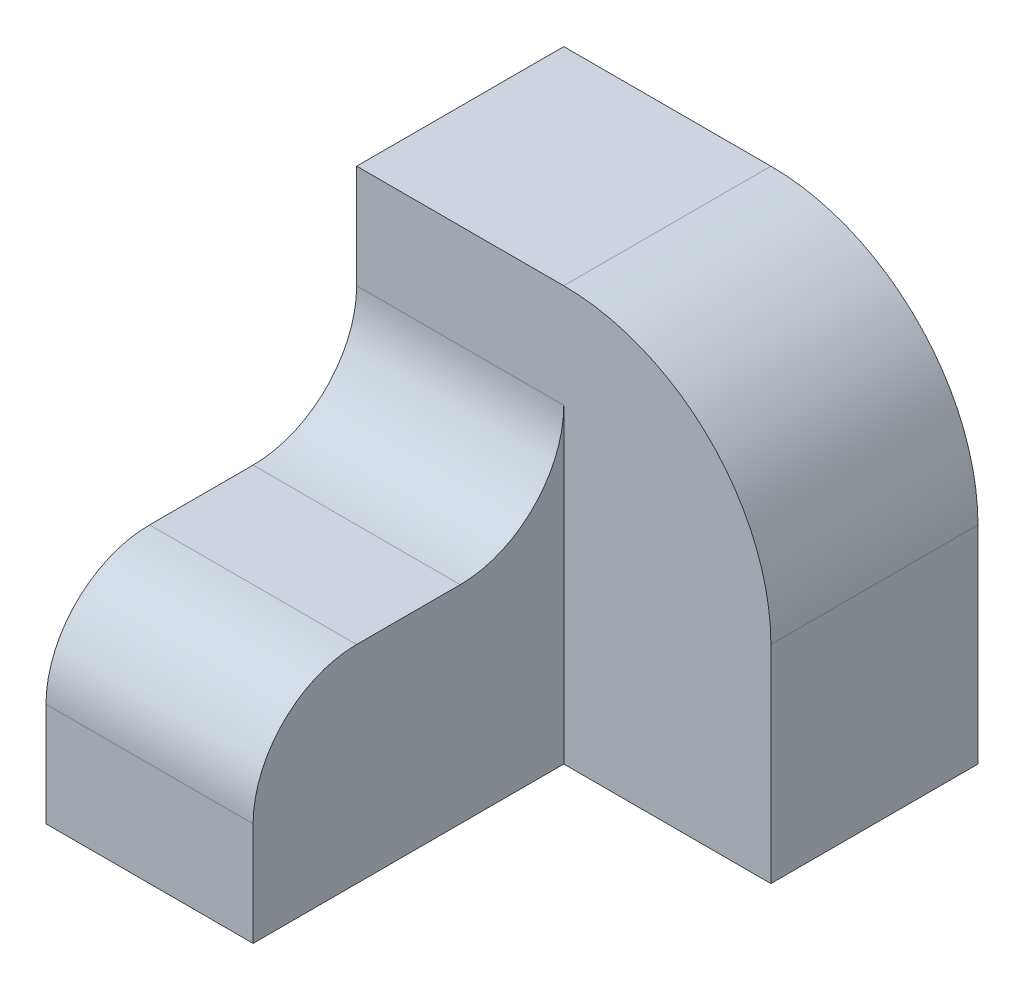
ISO-10303-21;
HEADER;
FILE_DESCRIPTION(('STEP AP214'),'2;1');
FILE_NAME('part.step','',(''),(''),'','','');
FILE_SCHEMA(('AUTOMOTIVE_DESIGN { 1 0 10303 214 1 1 1 1 }'));
ENDSEC;
DATA;
#1=APPLICATION_CONTEXT('core data for automotive mechanical design processes');
#2=APPLICATION_PROTOCOL_DEFINITION('international standard','automotive_design',2000,#1);
#3=PRODUCT_CONTEXT('',#1,'mechanical');
#4=PRODUCT('Part','Part','',(#3));
#5=PRODUCT_RELATED_PRODUCT_CATEGORY('part','',(#4));
#6=PRODUCT_DEFINITION_FORMATION('','',#4);
#7=PRODUCT_DEFINITION_CONTEXT('part definition',#1,'design');
#8=PRODUCT_DEFINITION('design','',#6,#7);
#9=PRODUCT_DEFINITION_SHAPE('','',#8);
#10=(LENGTH_UNIT() NAMED_UNIT(*) SI_UNIT(.MILLI.,.METRE.));
#11=(NAMED_UNIT(*) PLANE_ANGLE_UNIT() SI_UNIT($,.RADIAN.));
#12=(NAMED_UNIT(*) SI_UNIT($,.STERADIAN.) SOLID_ANGLE_UNIT());
#13=UNCERTAINTY_MEASURE_WITH_UNIT(LENGTH_MEASURE(1.E-05),#10,'distance_accuracy_value','');
#14=(GEOMETRIC_REPRESENTATION_CONTEXT(3) GLOBAL_UNCERTAINTY_ASSIGNED_CONTEXT((#13)) GLOBAL_UNIT_ASSIGNED_CONTEXT((#10,
#11,#12)) REPRESENTATION_CONTEXT('',''));
#15=CARTESIAN_POINT('',(0.,0.,0.));
#16=DIRECTION('',(0.,0.,1.));
#17=DIRECTION('',(1.,0.,0.));
#18=AXIS2_PLACEMENT_3D('',#15,#16,#17);
#19=CARTESIAN_POINT('',(10.,10.,0.));
#20=DIRECTION('',(1.,0.,0.));
#21=DIRECTION('',(0.,0.,-1.));
#22=AXIS2_PLACEMENT_3D('',#19,#20,#21);
#23=PLANE('',#22);
#24=DIRECTION('',(0.,0.,1.));
#25=VECTOR('',#24,1.);
#26=CARTESIAN_POINT('',(10.,10.,0.));
#27=LINE('',#26,#25);
#28=CARTESIAN_POINT('',(10.,10.,5.));
#29=VERTEX_POINT('',#28);
#30=CARTESIAN_POINT('',(10.,10.,10.));
#31=VERTEX_POINT('',#30);
#32=EDGE_CURVE('E154',#29,#31,#27,.T.);
#33=ORIENTED_EDGE('',*,*,#32,.T.);
#34=CARTESIAN_POINT('',(10.,5.,10.));
#35=DIRECTION('',(1.,0.,0.));
#36=DIRECTION('',(0.,0.,-1.));
#37=AXIS2_PLACEMENT_3D('',#34,#35,#36);
#38=CIRCLE('',#37,5.);
#39=CARTESIAN_POINT('',(10.,5.,15.));
#40=VERTEX_POINT('',#39);
#41=EDGE_CURVE('E182',#31,#40,#38,.T.);
#42=ORIENTED_EDGE('',*,*,#41,.T.);
#43=DIRECTION('',(0.,-1.,0.));
#44=VECTOR('',#43,1.);
#45=CARTESIAN_POINT('',(10.,10.,15.));
#46=LINE('',#45,#44);
#47=CARTESIAN_POINT('',(10.,0.,15.));
#48=VERTEX_POINT('',#47);
#49=EDGE_CURVE('E161',#40,#48,#46,.T.);
#50=ORIENTED_EDGE('',*,*,#49,.T.);
#51=DIRECTION('',(0.,0.,1.));
#52=VECTOR('',#51,1.);
#53=CARTESIAN_POINT('',(10.,0.,0.));
#54=LINE('',#53,#52);
#55=CARTESIAN_POINT('',(10.,0.,0.));
#56=VERTEX_POINT('',#55);
#57=EDGE_CURVE('E153',#56,#48,#54,.T.);
#58=ORIENTED_EDGE('',*,*,#57,.F.);
#59=DIRECTION('',(0.,-1.,0.));
#60=VECTOR('',#59,1.);
#61=CARTESIAN_POINT('',(10.,10.,0.));
#62=LINE('',#61,#60);
#63=CARTESIAN_POINT('',(10.,15.,0.));
#64=VERTEX_POINT('',#63);
#65=EDGE_CURVE('E171',#64,#56,#62,.T.);
#66=ORIENTED_EDGE('',*,*,#65,.F.);
#67=CARTESIAN_POINT('',(10.,15.,5.));
#68=DIRECTION('',(1.,0.,0.));
#69=DIRECTION('',(0.,0.,-1.));
#70=AXIS2_PLACEMENT_3D('',#67,#68,#69);
#71=CIRCLE('',#70,5.);
#72=EDGE_CURVE('E188',#64,#29,#71,.F.);
#73=ORIENTED_EDGE('',*,*,#72,.T.);
#74=EDGE_LOOP('',(#33,#42,#50,#58,#66,#73));
#75=FACE_BOUND('',#74,.T.);
#76=ADVANCED_FACE('F39',(#75),#23,.T.);
#77=CARTESIAN_POINT('',(0.,10.,0.));
#78=DIRECTION('',(1.,0.,0.));
#79=DIRECTION('',(0.,0.,-1.));
#80=AXIS2_PLACEMENT_3D('',#77,#78,#79);
#81=PLANE('',#80);
#82=DIRECTION('',(0.,-1.,0.));
#83=VECTOR('',#82,1.);
#84=CARTESIAN_POINT('',(0.,10.,15.));
#85=LINE('',#84,#83);
#86=CARTESIAN_POINT('',(0.,5.,15.));
#87=VERTEX_POINT('',#86);
#88=CARTESIAN_POINT('',(0.,0.,15.));
#89=VERTEX_POINT('',#88);
#90=EDGE_CURVE('E169',#87,#89,#85,.T.);
#91=ORIENTED_EDGE('',*,*,#90,.F.);
#92=CARTESIAN_POINT('',(0.,5.,10.));
#93=DIRECTION('',(1.,0.,0.));
#94=DIRECTION('',(0.,0.,-1.));
#95=AXIS2_PLACEMENT_3D('',#92,#93,#94);
#96=CIRCLE('',#95,5.);
#97=CARTESIAN_POINT('',(0.,10.,10.));
#98=VERTEX_POINT('',#97);
#99=EDGE_CURVE('E186',#87,#98,#96,.F.);
#100=ORIENTED_EDGE('',*,*,#99,.T.);
#101=DIRECTION('',(0.,0.,1.));
#102=VECTOR('',#101,1.);
#103=CARTESIAN_POINT('',(0.,10.,0.));
#104=LINE('',#103,#102);
#105=CARTESIAN_POINT('',(0.,10.,5.));
#106=VERTEX_POINT('',#105);
#107=EDGE_CURVE('E157',#106,#98,#104,.T.);
#108=ORIENTED_EDGE('',*,*,#107,.F.);
#109=CARTESIAN_POINT('',(0.,15.,5.));
#110=DIRECTION('',(1.,0.,0.));
#111=DIRECTION('',(0.,0.,-1.));
#112=AXIS2_PLACEMENT_3D('',#109,#110,#111);
#113=CIRCLE('',#112,5.);
#114=CARTESIAN_POINT('',(0.,15.,0.));
#115=VERTEX_POINT('',#114);
#116=EDGE_CURVE('E190',#106,#115,#113,.T.);
#117=ORIENTED_EDGE('',*,*,#116,.T.);
#118=DIRECTION('',(0.,-1.,0.));
#119=VECTOR('',#118,1.);
#120=CARTESIAN_POINT('',(0.,20.,0.));
#121=LINE('',#120,#119);
#122=CARTESIAN_POINT('',(0.,20.,0.));
#123=VERTEX_POINT('',#122);
#124=EDGE_CURVE('E123',#123,#115,#121,.T.);
#125=ORIENTED_EDGE('',*,*,#124,.F.);
#126=DIRECTION('',(0.,0.,-1.));
#127=VECTOR('',#126,1.);
#128=CARTESIAN_POINT('',(0.,20.,0.));
#129=LINE('',#128,#127);
#130=CARTESIAN_POINT('',(0.,20.,-10.));
#131=VERTEX_POINT('',#130);
#132=EDGE_CURVE('E130',#123,#131,#129,.T.);
#133=ORIENTED_EDGE('',*,*,#132,.T.);
#134=DIRECTION('',(0.,-1.,0.));
#135=VECTOR('',#134,1.);
#136=CARTESIAN_POINT('',(0.,20.,-10.));
#137=LINE('',#136,#135);
#138=CARTESIAN_POINT('',(0.,0.,-10.));
#139=VERTEX_POINT('',#138);
#140=EDGE_CURVE('E113',#131,#139,#137,.T.);
#141=ORIENTED_EDGE('',*,*,#140,.T.);
#142=DIRECTION('',(0.,0.,1.));
#143=VECTOR('',#142,1.);
#144=CARTESIAN_POINT('',(0.,0.,0.));
#145=LINE('',#144,#143);
#146=EDGE_CURVE('E164',#139,#89,#145,.T.);
#147=ORIENTED_EDGE('',*,*,#146,.T.);
#148=EDGE_LOOP('',(#91,#100,#108,#117,#125,#133,#141,#147));
#149=FACE_BOUND('',#148,.T.);
#150=ADVANCED_FACE('F136',(#149),#81,.F.);
#151=CARTESIAN_POINT('',(0.,10.,15.));
#152=DIRECTION('',(0.,0.,-1.));
#153=DIRECTION('',(-1.,0.,0.));
#154=AXIS2_PLACEMENT_3D('',#151,#152,#153);
#155=PLANE('',#154);
#156=ORIENTED_EDGE('',*,*,#49,.F.);
#157=DIRECTION('',(1.,0.,0.));
#158=VECTOR('',#157,1.);
#159=CARTESIAN_POINT('',(0.,5.,15.));
#160=LINE('',#159,#158);
#161=EDGE_CURVE('E184',#40,#87,#160,.F.);
#162=ORIENTED_EDGE('',*,*,#161,.T.);
#163=ORIENTED_EDGE('',*,*,#90,.T.);
#164=DIRECTION('',(1.,0.,0.));
#165=VECTOR('',#164,1.);
#166=CARTESIAN_POINT('',(0.,0.,15.));
#167=LINE('',#166,#165);
#168=EDGE_CURVE('E158',#89,#48,#167,.T.);
#169=ORIENTED_EDGE('',*,*,#168,.T.);
#170=EDGE_LOOP('',(#156,#162,#163,#169));
#171=FACE_BOUND('',#170,.T.);
#172=ADVANCED_FACE('F213',(#171),#155,.F.);
#173=CARTESIAN_POINT('',(0.,10.,0.));
#174=DIRECTION('',(0.,1.,0.));
#175=DIRECTION('',(0.,0.,1.));
#176=AXIS2_PLACEMENT_3D('',#173,#174,#175);
#177=PLANE('',#176);
#178=ORIENTED_EDGE('',*,*,#32,.F.);
#179=DIRECTION('',(1.,0.,0.));
#180=VECTOR('',#179,1.);
#181=CARTESIAN_POINT('',(0.,10.,5.));
#182=LINE('',#181,#180);
#183=EDGE_CURVE('E180',#29,#106,#182,.F.);
#184=ORIENTED_EDGE('',*,*,#183,.T.);
#185=ORIENTED_EDGE('',*,*,#107,.T.);
#186=DIRECTION('',(1.,0.,0.));
#187=VECTOR('',#186,1.);
#188=CARTESIAN_POINT('',(10.,10.,10.));
#189=LINE('',#188,#187);
#190=EDGE_CURVE('E177',#98,#31,#189,.T.);
#191=ORIENTED_EDGE('',*,*,#190,.T.);
#192=EDGE_LOOP('',(#178,#184,#185,#191));
#193=FACE_BOUND('',#192,.T.);
#194=ADVANCED_FACE('F205',(#193),#177,.T.);
#195=CARTESIAN_POINT('',(0.,0.,0.));
#196=DIRECTION('',(0.,1.,0.));
#197=DIRECTION('',(0.,0.,1.));
#198=AXIS2_PLACEMENT_3D('',#195,#196,#197);
#199=PLANE('',#198);
#200=ORIENTED_EDGE('',*,*,#57,.T.);
#201=ORIENTED_EDGE('',*,*,#168,.F.);
#202=ORIENTED_EDGE('',*,*,#146,.F.);
#203=DIRECTION('',(1.,0.,0.));
#204=VECTOR('',#203,1.);
#205=CARTESIAN_POINT('',(0.,0.,-10.));
#206=LINE('',#205,#204);
#207=CARTESIAN_POINT('',(20.,0.,-10.));
#208=VERTEX_POINT('',#207);
#209=EDGE_CURVE('E118',#139,#208,#206,.T.);
#210=ORIENTED_EDGE('',*,*,#209,.T.);
#211=DIRECTION('',(0.,0.,-1.));
#212=VECTOR('',#211,1.);
#213=CARTESIAN_POINT('',(20.,0.,0.));
#214=LINE('',#213,#212);
#215=CARTESIAN_POINT('',(20.,0.,0.));
#216=VERTEX_POINT('',#215);
#217=EDGE_CURVE('E146',#216,#208,#214,.T.);
#218=ORIENTED_EDGE('',*,*,#217,.F.);
#219=DIRECTION('',(1.,0.,0.));
#220=VECTOR('',#219,1.);
#221=CARTESIAN_POINT('',(0.,0.,0.));
#222=LINE('',#221,#220);
#223=EDGE_CURVE('E143',#56,#216,#222,.T.);
#224=ORIENTED_EDGE('',*,*,#223,.F.);
#225=EDGE_LOOP('',(#200,#201,#202,#210,#218,#224));
#226=FACE_BOUND('',#225,.T.);
#227=ADVANCED_FACE('F217',(#226),#199,.F.);
#228=CARTESIAN_POINT('',(0.,20.,0.));
#229=DIRECTION('',(0.,0.,-1.));
#230=DIRECTION('',(-1.,0.,0.));
#231=AXIS2_PLACEMENT_3D('',#228,#229,#230);
#232=PLANE('',#231);
#233=DIRECTION('',(0.,-1.,0.));
#234=VECTOR('',#233,1.);
#235=CARTESIAN_POINT('',(20.,20.,0.));
#236=LINE('',#235,#234);
#237=CARTESIAN_POINT('',(20.,10.,0.));
#238=VERTEX_POINT('',#237);
#239=EDGE_CURVE('E151',#238,#216,#236,.T.);
#240=ORIENTED_EDGE('',*,*,#239,.F.);
#241=CARTESIAN_POINT('',(10.,10.,0.));
#242=DIRECTION('',(0.,0.,-1.));
#243=DIRECTION('',(-1.,0.,0.));
#244=AXIS2_PLACEMENT_3D('',#241,#242,#243);
#245=CIRCLE('',#244,10.);
#246=CARTESIAN_POINT('',(10.,20.,0.));
#247=VERTEX_POINT('',#246);
#248=EDGE_CURVE('E11',#238,#247,#245,.F.);
#249=ORIENTED_EDGE('',*,*,#248,.T.);
#250=DIRECTION('',(1.,0.,0.));
#251=VECTOR('',#250,1.);
#252=CARTESIAN_POINT('',(0.,20.,0.));
#253=LINE('',#252,#251);
#254=EDGE_CURVE('E133',#123,#247,#253,.T.);
#255=ORIENTED_EDGE('',*,*,#254,.F.);
#256=ORIENTED_EDGE('',*,*,#124,.T.);
#257=DIRECTION('',(1.,0.,0.));
#258=VECTOR('',#257,1.);
#259=CARTESIAN_POINT('',(0.,15.,0.));
#260=LINE('',#259,#258);
#261=EDGE_CURVE('E174',#115,#64,#260,.T.);
#262=ORIENTED_EDGE('',*,*,#261,.T.);
#263=ORIENTED_EDGE('',*,*,#65,.T.);
#264=ORIENTED_EDGE('',*,*,#223,.T.);
#265=EDGE_LOOP('',(#240,#249,#255,#256,#262,#263,#264));
#266=FACE_BOUND('',#265,.T.);
#267=ADVANCED_FACE('F199',(#266),#232,.F.);
#268=CARTESIAN_POINT('',(20.,20.,0.));
#269=DIRECTION('',(-1.,0.,0.));
#270=DIRECTION('',(0.,0.,1.));
#271=AXIS2_PLACEMENT_3D('',#268,#269,#270);
#272=PLANE('',#271);
#273=DIRECTION('',(0.,-1.,0.));
#274=VECTOR('',#273,1.);
#275=CARTESIAN_POINT('',(20.,20.,-10.));
#276=LINE('',#275,#274);
#277=CARTESIAN_POINT('',(20.,10.,-10.));
#278=VERTEX_POINT('',#277);
#279=EDGE_CURVE('E122',#278,#208,#276,.T.);
#280=ORIENTED_EDGE('',*,*,#279,.F.);
#281=DIRECTION('',(0.,0.,-1.));
#282=VECTOR('',#281,1.);
#283=CARTESIAN_POINT('',(20.,10.,0.));
#284=LINE('',#283,#282);
#285=EDGE_CURVE('E47',#278,#238,#284,.F.);
#286=ORIENTED_EDGE('',*,*,#285,.T.);
#287=ORIENTED_EDGE('',*,*,#239,.T.);
#288=ORIENTED_EDGE('',*,*,#217,.T.);
#289=EDGE_LOOP('',(#280,#286,#287,#288));
#290=FACE_BOUND('',#289,.T.);
#291=ADVANCED_FACE('F220',(#290),#272,.F.);
#292=CARTESIAN_POINT('',(0.,20.,-10.));
#293=DIRECTION('',(0.,0.,-1.));
#294=DIRECTION('',(-1.,0.,0.));
#295=AXIS2_PLACEMENT_3D('',#292,#293,#294);
#296=PLANE('',#295);
#297=DIRECTION('',(1.,0.,0.));
#298=VECTOR('',#297,1.);
#299=CARTESIAN_POINT('',(0.,20.,-10.));
#300=LINE('',#299,#298);
#301=CARTESIAN_POINT('',(10.,20.,-10.));
#302=VERTEX_POINT('',#301);
#303=EDGE_CURVE('E116',#131,#302,#300,.T.);
#304=ORIENTED_EDGE('',*,*,#303,.T.);
#305=CARTESIAN_POINT('',(10.,10.,-10.));
#306=DIRECTION('',(0.,0.,-1.));
#307=DIRECTION('',(-1.,0.,0.));
#308=AXIS2_PLACEMENT_3D('',#305,#306,#307);
#309=CIRCLE('',#308,10.);
#310=EDGE_CURVE('E61',#302,#278,#309,.T.);
#311=ORIENTED_EDGE('',*,*,#310,.T.);
#312=ORIENTED_EDGE('',*,*,#279,.T.);
#313=ORIENTED_EDGE('',*,*,#209,.F.);
#314=ORIENTED_EDGE('',*,*,#140,.F.);
#315=EDGE_LOOP('',(#304,#311,#312,#313,#314));
#316=FACE_BOUND('',#315,.T.);
#317=ADVANCED_FACE('F115',(#316),#296,.T.);
#318=CARTESIAN_POINT('',(0.,20.,0.));
#319=DIRECTION('',(0.,1.,0.));
#320=DIRECTION('',(0.,0.,1.));
#321=AXIS2_PLACEMENT_3D('',#318,#319,#320);
#322=PLANE('',#321);
#323=ORIENTED_EDGE('',*,*,#254,.T.);
#324=DIRECTION('',(0.,0.,-1.));
#325=VECTOR('',#324,1.);
#326=CARTESIAN_POINT('',(10.,20.,-10.));
#327=LINE('',#326,#325);
#328=EDGE_CURVE('E132',#247,#302,#327,.T.);
#329=ORIENTED_EDGE('',*,*,#328,.T.);
#330=ORIENTED_EDGE('',*,*,#303,.F.);
#331=ORIENTED_EDGE('',*,*,#132,.F.);
#332=EDGE_LOOP('',(#323,#329,#330,#331));
#333=FACE_BOUND('',#332,.T.);
#334=ADVANCED_FACE('F129',(#333),#322,.T.);
#335=CARTESIAN_POINT('',(0.,15.,5.));
#336=DIRECTION('',(1.,0.,0.));
#337=DIRECTION('',(0.,0.,-1.));
#338=AXIS2_PLACEMENT_3D('',#335,#336,#337);
#339=CYLINDRICAL_SURFACE('',#338,5.);
#340=ORIENTED_EDGE('',*,*,#116,.F.);
#341=ORIENTED_EDGE('',*,*,#183,.F.);
#342=ORIENTED_EDGE('',*,*,#72,.F.);
#343=ORIENTED_EDGE('',*,*,#261,.F.);
#344=EDGE_LOOP('',(#340,#341,#342,#343));
#345=FACE_BOUND('',#344,.T.);
#346=ADVANCED_FACE('F201',(#345),#339,.F.);
#347=CARTESIAN_POINT('',(0.,5.,10.));
#348=DIRECTION('',(-1.,0.,0.));
#349=DIRECTION('',(0.,0.,1.));
#350=AXIS2_PLACEMENT_3D('',#347,#348,#349);
#351=CYLINDRICAL_SURFACE('',#350,5.);
#352=ORIENTED_EDGE('',*,*,#99,.F.);
#353=ORIENTED_EDGE('',*,*,#161,.F.);
#354=ORIENTED_EDGE('',*,*,#41,.F.);
#355=ORIENTED_EDGE('',*,*,#190,.F.);
#356=EDGE_LOOP('',(#352,#353,#354,#355));
#357=FACE_BOUND('',#356,.T.);
#358=ADVANCED_FACE('F209',(#357),#351,.T.);
#359=CARTESIAN_POINT('',(10.,10.,0.));
#360=DIRECTION('',(0.,0.,1.));
#361=DIRECTION('',(1.,0.,0.));
#362=AXIS2_PLACEMENT_3D('',#359,#360,#361);
#363=CYLINDRICAL_SURFACE('',#362,10.);
#364=ORIENTED_EDGE('',*,*,#248,.F.);
#365=ORIENTED_EDGE('',*,*,#285,.F.);
#366=ORIENTED_EDGE('',*,*,#310,.F.);
#367=ORIENTED_EDGE('',*,*,#328,.F.);
#368=EDGE_LOOP('',(#364,#365,#366,#367));
#369=FACE_BOUND('',#368,.T.);
#370=ADVANCED_FACE('F41',(#369),#363,.T.);
#371=CLOSED_SHELL('',(#76,#150,#172,#194,#227,#267,#291,#317,#334,#346,#358,#370));
#372=MANIFOLD_SOLID_BREP('B2',#371);
#373=ADVANCED_BREP_SHAPE_REPRESENTATION('',(#18,#372),#14);
#374=SHAPE_DEFINITION_REPRESENTATION(#9,#373);
ENDSEC;
END-ISO-10303-21;
